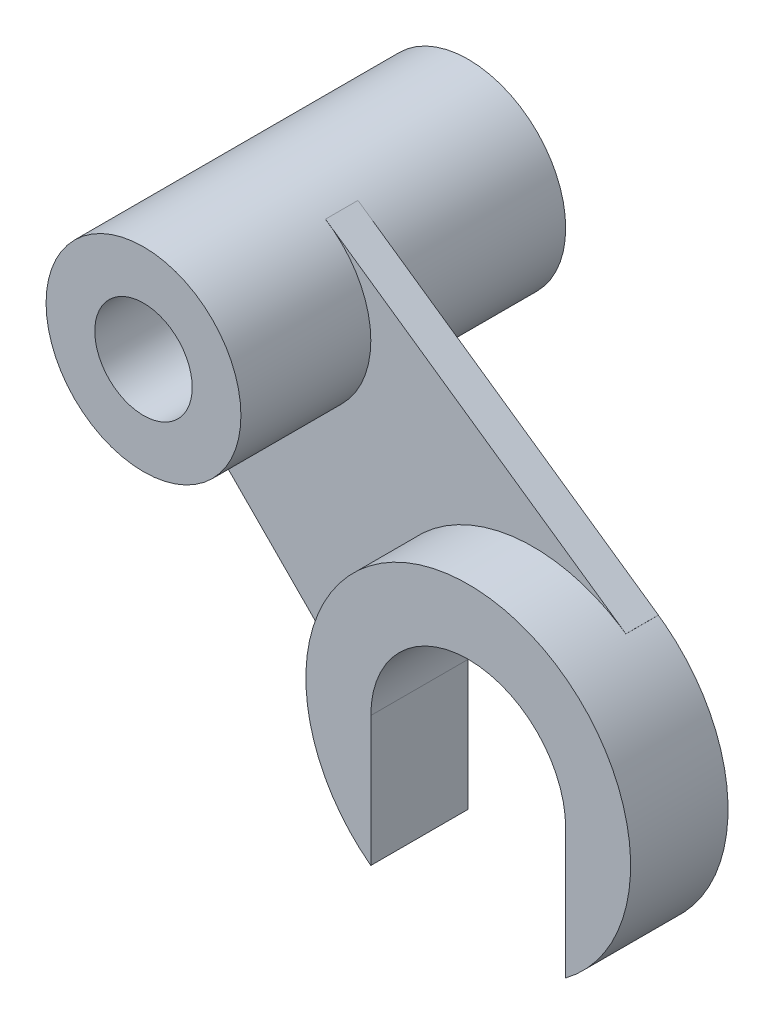
ISO-10303-21;
HEADER;
FILE_DESCRIPTION(('STEP AP214'),'2;1');
FILE_NAME('part.step','',(''),(''),'','','');
FILE_SCHEMA(('AUTOMOTIVE_DESIGN { 1 0 10303 214 1 1 1 1 }'));
ENDSEC;
DATA;
#1=APPLICATION_CONTEXT('core data for automotive mechanical design processes');
#2=APPLICATION_PROTOCOL_DEFINITION('international standard','automotive_design',2000,#1);
#3=PRODUCT_CONTEXT('',#1,'mechanical');
#4=PRODUCT('Part','Part','',(#3));
#5=PRODUCT_RELATED_PRODUCT_CATEGORY('part','',(#4));
#6=PRODUCT_DEFINITION_FORMATION('','',#4);
#7=PRODUCT_DEFINITION_CONTEXT('part definition',#1,'design');
#8=PRODUCT_DEFINITION('design','',#6,#7);
#9=PRODUCT_DEFINITION_SHAPE('','',#8);
#10=(LENGTH_UNIT() NAMED_UNIT(*) SI_UNIT(.MILLI.,.METRE.));
#11=(NAMED_UNIT(*) PLANE_ANGLE_UNIT() SI_UNIT($,.RADIAN.));
#12=(NAMED_UNIT(*) SI_UNIT($,.STERADIAN.) SOLID_ANGLE_UNIT());
#13=UNCERTAINTY_MEASURE_WITH_UNIT(LENGTH_MEASURE(1.E-05),#10,'distance_accuracy_value','');
#14=(GEOMETRIC_REPRESENTATION_CONTEXT(3) GLOBAL_UNCERTAINTY_ASSIGNED_CONTEXT((#13)) GLOBAL_UNIT_ASSIGNED_CONTEXT((#10,
#11,#12)) REPRESENTATION_CONTEXT('',''));
#15=CARTESIAN_POINT('',(0.,0.,0.));
#16=DIRECTION('',(0.,0.,1.));
#17=DIRECTION('',(1.,0.,0.));
#18=AXIS2_PLACEMENT_3D('',#15,#16,#17);
#19=CARTESIAN_POINT('',(-101.405140794996,67.6303169758458,10.));
#20=DIRECTION('',(-0.821220590072769,-0.570610850265339,0.));
#21=DIRECTION('',(0.570610850265339,-0.821220590072769,0.));
#22=AXIS2_PLACEMENT_3D('',#19,#20,#21);
#23=PLANE('',#22);
#24=DIRECTION('',(-0.570610850265339,0.821220590072769,0.));
#25=VECTOR('',#24,1.);
#26=CARTESIAN_POINT('',(-101.405140794996,67.6303169758458,0.));
#27=LINE('',#26,#25);
#28=CARTESIAN_POINT('',(-101.405140794996,67.6303169758458,0.));
#29=VERTEX_POINT('',#28);
#30=CARTESIAN_POINT('',(-110.,80.,0.));
#31=VERTEX_POINT('',#30);
#32=EDGE_CURVE('E164',#29,#31,#27,.T.);
#33=ORIENTED_EDGE('',*,*,#32,.T.);
#34=DIRECTION('',(0.,0.,-1.));
#35=VECTOR('',#34,1.);
#36=CARTESIAN_POINT('',(-110.,80.,10.));
#37=LINE('',#36,#35);
#38=CARTESIAN_POINT('',(-110.,80.,10.));
#39=VERTEX_POINT('',#38);
#40=EDGE_CURVE('E12',#39,#31,#37,.T.);
#41=ORIENTED_EDGE('',*,*,#40,.F.);
#42=DIRECTION('',(-0.570610850265339,0.821220590072769,0.));
#43=VECTOR('',#42,1.);
#44=CARTESIAN_POINT('',(-101.405140794996,67.6303169758458,10.));
#45=LINE('',#44,#43);
#46=CARTESIAN_POINT('',(-101.405140794996,67.6303169758458,10.));
#47=VERTEX_POINT('',#46);
#48=EDGE_CURVE('E184',#47,#39,#45,.T.);
#49=ORIENTED_EDGE('',*,*,#48,.F.);
#50=DIRECTION('',(0.,0.,-1.));
#51=VECTOR('',#50,1.);
#52=CARTESIAN_POINT('',(-101.405140794996,67.6303169758458,10.));
#53=LINE('',#52,#51);
#54=EDGE_CURVE('E160',#47,#29,#53,.T.);
#55=ORIENTED_EDGE('',*,*,#54,.T.);
#56=EDGE_LOOP('',(#33,#41,#49,#55));
#57=FACE_BOUND('',#56,.T.);
#58=ADVANCED_FACE('F50',(#57),#23,.F.);
#59=CARTESIAN_POINT('',(-110.,80.,10.));
#60=DIRECTION('',(1.,0.,0.));
#61=DIRECTION('',(0.,0.,-1.));
#62=AXIS2_PLACEMENT_3D('',#59,#60,#61);
#63=PLANE('',#62);
#64=DIRECTION('',(0.,-1.,0.));
#65=VECTOR('',#64,1.);
#66=CARTESIAN_POINT('',(-110.,80.,0.));
#67=LINE('',#66,#65);
#68=CARTESIAN_POINT('',(-110.,40.,0.));
#69=VERTEX_POINT('',#68);
#70=EDGE_CURVE('E167',#31,#69,#67,.T.);
#71=ORIENTED_EDGE('',*,*,#70,.T.);
#72=DIRECTION('',(0.,0.,-1.));
#73=VECTOR('',#72,1.);
#74=CARTESIAN_POINT('',(-110.,40.,10.));
#75=LINE('',#74,#73);
#76=CARTESIAN_POINT('',(-110.,40.,10.));
#77=VERTEX_POINT('',#76);
#78=EDGE_CURVE('E58',#77,#69,#75,.T.);
#79=ORIENTED_EDGE('',*,*,#78,.F.);
#80=DIRECTION('',(0.,-1.,0.));
#81=VECTOR('',#80,1.);
#82=CARTESIAN_POINT('',(-110.,80.,10.));
#83=LINE('',#82,#81);
#84=EDGE_CURVE('E118',#39,#77,#83,.T.);
#85=ORIENTED_EDGE('',*,*,#84,.F.);
#86=ORIENTED_EDGE('',*,*,#40,.T.);
#87=EDGE_LOOP('',(#71,#79,#85,#86));
#88=FACE_BOUND('',#87,.T.);
#89=ADVANCED_FACE('F256',(#88),#63,.F.);
#90=CARTESIAN_POINT('',(-110.,40.,10.));
#91=DIRECTION('',(0.710452707861558,0.703744946619285,0.));
#92=DIRECTION('',(-0.703744946619285,0.710452707861558,0.));
#93=AXIS2_PLACEMENT_3D('',#90,#91,#92);
#94=PLANE('',#93);
#95=DIRECTION('',(0.703744946619285,-0.710452707861558,0.));
#96=VECTOR('',#95,1.);
#97=CARTESIAN_POINT('',(-110.,40.,0.));
#98=LINE('',#97,#96);
#99=CARTESIAN_POINT('',(-35.5226353930779,-35.1872473309642,0.));
#100=VERTEX_POINT('',#99);
#101=EDGE_CURVE('E169',#69,#100,#98,.T.);
#102=ORIENTED_EDGE('',*,*,#101,.T.);
#103=DIRECTION('',(0.,0.,-1.));
#104=VECTOR('',#103,1.);
#105=CARTESIAN_POINT('',(-35.5226353930779,-35.1872473309642,10.));
#106=LINE('',#105,#104);
#107=CARTESIAN_POINT('',(-35.5226353930779,-35.1872473309642,10.));
#108=VERTEX_POINT('',#107);
#109=EDGE_CURVE('E200',#108,#100,#106,.T.);
#110=ORIENTED_EDGE('',*,*,#109,.F.);
#111=DIRECTION('',(0.703744946619285,-0.710452707861558,0.));
#112=VECTOR('',#111,1.);
#113=CARTESIAN_POINT('',(-110.,40.,10.));
#114=LINE('',#113,#112);
#115=EDGE_CURVE('E208',#77,#108,#114,.T.);
#116=ORIENTED_EDGE('',*,*,#115,.F.);
#117=ORIENTED_EDGE('',*,*,#78,.T.);
#118=EDGE_LOOP('',(#102,#110,#116,#117));
#119=FACE_BOUND('',#118,.T.);
#120=ADVANCED_FACE('F206',(#119),#94,.F.);
#121=CARTESIAN_POINT('',(-35.5226353930779,-35.1872473309642,10.));
#122=DIRECTION('',(-1.,0.,0.));
#123=DIRECTION('',(0.,0.,1.));
#124=AXIS2_PLACEMENT_3D('',#121,#122,#123);
#125=PLANE('',#124);
#126=DIRECTION('',(0.,1.,0.));
#127=VECTOR('',#126,1.);
#128=CARTESIAN_POINT('',(-35.5226353930779,-35.1872473309642,0.));
#129=LINE('',#128,#127);
#130=CARTESIAN_POINT('',(-35.5226353930779,24.4244066469658,0.));
#131=VERTEX_POINT('',#130);
#132=EDGE_CURVE('E171',#100,#131,#129,.T.);
#133=ORIENTED_EDGE('',*,*,#132,.T.);
#134=DIRECTION('',(0.,0.,-1.));
#135=VECTOR('',#134,1.);
#136=CARTESIAN_POINT('',(-35.5226353930779,24.4244066469658,10.));
#137=LINE('',#136,#135);
#138=CARTESIAN_POINT('',(-35.5226353930779,24.4244066469658,10.));
#139=VERTEX_POINT('',#138);
#140=EDGE_CURVE('E197',#139,#131,#137,.T.);
#141=ORIENTED_EDGE('',*,*,#140,.F.);
#142=DIRECTION('',(0.,1.,0.));
#143=VECTOR('',#142,1.);
#144=CARTESIAN_POINT('',(-35.5226353930779,-35.1872473309642,10.));
#145=LINE('',#144,#143);
#146=EDGE_CURVE('E226',#108,#139,#145,.T.);
#147=ORIENTED_EDGE('',*,*,#146,.F.);
#148=ORIENTED_EDGE('',*,*,#109,.T.);
#149=EDGE_LOOP('',(#133,#141,#147,#148));
#150=FACE_BOUND('',#149,.T.);
#151=ADVANCED_FACE('F217',(#150),#125,.F.);
#152=CARTESIAN_POINT('',(-35.5226353930779,24.4244066469658,10.));
#153=DIRECTION('',(-0.401563978992684,0.915830972819528,0.));
#154=DIRECTION('',(-0.915830972819528,-0.401563978992684,0.));
#155=AXIS2_PLACEMENT_3D('',#152,#153,#154);
#156=PLANE('',#155);
#157=DIRECTION('',(0.915830972819528,0.401563978992684,0.));
#158=VECTOR('',#157,1.);
#159=CARTESIAN_POINT('',(-35.5226353930779,24.4244066469658,0.));
#160=LINE('',#159,#158);
#161=CARTESIAN_POINT('',(0.,40.,0.));
#162=VERTEX_POINT('',#161);
#163=EDGE_CURVE('E173',#131,#162,#160,.T.);
#164=ORIENTED_EDGE('',*,*,#163,.T.);
#165=DIRECTION('',(0.,0.,-1.));
#166=VECTOR('',#165,1.);
#167=CARTESIAN_POINT('',(0.,40.,10.));
#168=LINE('',#167,#166);
#169=CARTESIAN_POINT('',(0.,40.,10.));
#170=VERTEX_POINT('',#169);
#171=EDGE_CURVE('E194',#170,#162,#168,.T.);
#172=ORIENTED_EDGE('',*,*,#171,.F.);
#173=DIRECTION('',(0.915830972819528,0.401563978992684,0.));
#174=VECTOR('',#173,1.);
#175=CARTESIAN_POINT('',(-35.5226353930779,24.4244066469658,10.));
#176=LINE('',#175,#174);
#177=EDGE_CURVE('E223',#139,#170,#176,.T.);
#178=ORIENTED_EDGE('',*,*,#177,.F.);
#179=ORIENTED_EDGE('',*,*,#140,.T.);
#180=EDGE_LOOP('',(#164,#172,#178,#179));
#181=FACE_BOUND('',#180,.T.);
#182=ADVANCED_FACE('F221',(#181),#156,.F.);
#183=CARTESIAN_POINT('',(0.,40.,10.));
#184=DIRECTION('',(0.303855521522255,0.952718123077565,0.));
#185=DIRECTION('',(-0.952718123077565,0.303855521522255,0.));
#186=AXIS2_PLACEMENT_3D('',#183,#184,#185);
#187=PLANE('',#186);
#188=DIRECTION('',(0.952718123077565,-0.303855521522255,0.));
#189=VECTOR('',#188,1.);
#190=CARTESIAN_POINT('',(0.,40.,0.));
#191=LINE('',#190,#189);
#192=CARTESIAN_POINT('',(24.4181017194965,32.2122033234829,0.));
#193=VERTEX_POINT('',#192);
#194=EDGE_CURVE('E175',#162,#193,#191,.T.);
#195=ORIENTED_EDGE('',*,*,#194,.T.);
#196=DIRECTION('',(0.,0.,-1.));
#197=VECTOR('',#196,1.);
#198=CARTESIAN_POINT('',(24.4181017194965,32.2122033234829,10.));
#199=LINE('',#198,#197);
#200=CARTESIAN_POINT('',(24.4181017194965,32.2122033234829,10.));
#201=VERTEX_POINT('',#200);
#202=EDGE_CURVE('E191',#201,#193,#199,.T.);
#203=ORIENTED_EDGE('',*,*,#202,.F.);
#204=DIRECTION('',(0.952718123077565,-0.303855521522255,0.));
#205=VECTOR('',#204,1.);
#206=CARTESIAN_POINT('',(0.,40.,10.));
#207=LINE('',#206,#205);
#208=EDGE_CURVE('E225',#170,#201,#207,.T.);
#209=ORIENTED_EDGE('',*,*,#208,.F.);
#210=ORIENTED_EDGE('',*,*,#171,.T.);
#211=EDGE_LOOP('',(#195,#203,#209,#210));
#212=FACE_BOUND('',#211,.T.);
#213=ADVANCED_FACE('F269',(#212),#187,.F.);
#214=CARTESIAN_POINT('',(24.4181017194965,32.2122033234829,10.));
#215=DIRECTION('',(-0.905915500696514,0.423458505166427,0.));
#216=DIRECTION('',(-0.423458505166427,-0.905915500696514,0.));
#217=AXIS2_PLACEMENT_3D('',#214,#215,#216);
#218=PLANE('',#217);
#219=DIRECTION('',(0.423458505166427,0.905915500696514,0.));
#220=VECTOR('',#219,1.);
#221=CARTESIAN_POINT('',(24.4181017194965,32.2122033234829,0.));
#222=LINE('',#221,#220);
#223=CARTESIAN_POINT('',(28.5485272676876,41.0485272676876,0.));
#224=VERTEX_POINT('',#223);
#225=EDGE_CURVE('E177',#193,#224,#222,.T.);
#226=ORIENTED_EDGE('',*,*,#225,.T.);
#227=DIRECTION('',(0.,0.,-1.));
#228=VECTOR('',#227,1.);
#229=CARTESIAN_POINT('',(28.5485272676876,41.0485272676876,10.));
#230=LINE('',#229,#228);
#231=CARTESIAN_POINT('',(28.5485272676876,41.0485272676876,10.));
#232=VERTEX_POINT('',#231);
#233=EDGE_CURVE('E188',#232,#224,#230,.T.);
#234=ORIENTED_EDGE('',*,*,#233,.F.);
#235=DIRECTION('',(0.423458505166427,0.905915500696514,0.));
#236=VECTOR('',#235,1.);
#237=CARTESIAN_POINT('',(24.4181017194965,32.2122033234829,10.));
#238=LINE('',#237,#236);
#239=EDGE_CURVE('E228',#201,#232,#238,.T.);
#240=ORIENTED_EDGE('',*,*,#239,.F.);
#241=ORIENTED_EDGE('',*,*,#202,.T.);
#242=EDGE_LOOP('',(#226,#234,#240,#241));
#243=FACE_BOUND('',#242,.T.);
#244=ADVANCED_FACE('F237',(#243),#218,.F.);
#245=CARTESIAN_POINT('',(28.5485272676876,41.0485272676876,10.));
#246=DIRECTION('',(-0.570970545353753,-0.820970545353753,0.));
#247=DIRECTION('',(0.820970545353753,-0.570970545353753,0.));
#248=AXIS2_PLACEMENT_3D('',#245,#246,#247);
#249=PLANE('',#248);
#250=DIRECTION('',(-0.820970545353753,0.570970545353753,0.));
#251=VECTOR('',#250,1.);
#252=CARTESIAN_POINT('',(28.5485272676876,41.0485272676876,0.));
#253=LINE('',#252,#251);
#254=CARTESIAN_POINT('',(-63.9600885233091,105.386639161028,0.));
#255=VERTEX_POINT('',#254);
#256=EDGE_CURVE('E179',#224,#255,#253,.T.);
#257=ORIENTED_EDGE('',*,*,#256,.T.);
#258=DIRECTION('',(0.,0.,-1.));
#259=VECTOR('',#258,1.);
#260=CARTESIAN_POINT('',(-63.9600885233091,105.386639161028,10.));
#261=LINE('',#260,#259);
#262=CARTESIAN_POINT('',(-63.9600885233091,105.386639161028,10.));
#263=VERTEX_POINT('',#262);
#264=EDGE_CURVE('E155',#263,#255,#261,.T.);
#265=ORIENTED_EDGE('',*,*,#264,.F.);
#266=DIRECTION('',(-0.820970545353753,0.570970545353753,0.));
#267=VECTOR('',#266,1.);
#268=CARTESIAN_POINT('',(28.5485272676876,41.0485272676876,10.));
#269=LINE('',#268,#267);
#270=EDGE_CURVE('E146',#232,#263,#269,.T.);
#271=ORIENTED_EDGE('',*,*,#270,.F.);
#272=ORIENTED_EDGE('',*,*,#233,.T.);
#273=EDGE_LOOP('',(#257,#265,#271,#272));
#274=FACE_BOUND('',#273,.T.);
#275=ADVANCED_FACE('F241',(#274),#249,.F.);
#276=CARTESIAN_POINT('',(-63.9600885233091,105.386639161028,10.));
#277=DIRECTION('',(0.984250984251476,0.176776695296642,0.));
#278=DIRECTION('',(-0.176776695296642,0.984250984251476,0.));
#279=AXIS2_PLACEMENT_3D('',#276,#277,#278);
#280=PLANE('',#279);
#281=DIRECTION('',(0.176776695296642,-0.984250984251475,0.));
#282=VECTOR('',#281,1.);
#283=CARTESIAN_POINT('',(-63.9600885233091,105.386639161028,0.));
#284=LINE('',#283,#282);
#285=CARTESIAN_POINT('',(-57.4609690598027,69.2010734223432,0.));
#286=VERTEX_POINT('',#285);
#287=EDGE_CURVE('E154',#255,#286,#284,.T.);
#288=ORIENTED_EDGE('',*,*,#287,.T.);
#289=DIRECTION('',(0.,0.,-1.));
#290=VECTOR('',#289,1.);
#291=CARTESIAN_POINT('',(-57.4609690598027,69.2010734223432,10.));
#292=LINE('',#291,#290);
#293=CARTESIAN_POINT('',(-57.4609690598027,69.2010734223432,10.));
#294=VERTEX_POINT('',#293);
#295=EDGE_CURVE('E151',#294,#286,#292,.T.);
#296=ORIENTED_EDGE('',*,*,#295,.F.);
#297=DIRECTION('',(0.176776695296642,-0.984250984251475,0.));
#298=VECTOR('',#297,1.);
#299=CARTESIAN_POINT('',(-63.9600885233091,105.386639161028,10.));
#300=LINE('',#299,#298);
#301=EDGE_CURVE('E140',#263,#294,#300,.T.);
#302=ORIENTED_EDGE('',*,*,#301,.F.);
#303=ORIENTED_EDGE('',*,*,#264,.T.);
#304=EDGE_LOOP('',(#288,#296,#302,#303));
#305=FACE_BOUND('',#304,.T.);
#306=ADVANCED_FACE('F152',(#305),#280,.F.);
#307=CARTESIAN_POINT('',(-57.4609690598027,69.2010734223432,10.));
#308=DIRECTION('',(0.491035198471503,-0.871139732684747,0.));
#309=DIRECTION('',(0.871139732684747,0.491035198471503,0.));
#310=AXIS2_PLACEMENT_3D('',#307,#308,#309);
#311=PLANE('',#310);
#312=DIRECTION('',(-0.871139732684747,-0.491035198471503,0.));
#313=VECTOR('',#312,1.);
#314=CARTESIAN_POINT('',(-57.4609690598027,69.2010734223432,0.));
#315=LINE('',#314,#313);
#316=CARTESIAN_POINT('',(-82.9806424287928,54.8164030789865,0.));
#317=VERTEX_POINT('',#316);
#318=EDGE_CURVE('E104',#286,#317,#315,.T.);
#319=ORIENTED_EDGE('',*,*,#318,.T.);
#320=DIRECTION('',(0.,0.,-1.));
#321=VECTOR('',#320,1.);
#322=CARTESIAN_POINT('',(-82.9806424287928,54.8164030789865,10.));
#323=LINE('',#322,#321);
#324=CARTESIAN_POINT('',(-82.9806424287928,54.8164030789865,10.));
#325=VERTEX_POINT('',#324);
#326=EDGE_CURVE('E156',#325,#317,#323,.T.);
#327=ORIENTED_EDGE('',*,*,#326,.F.);
#328=DIRECTION('',(-0.871139732684747,-0.491035198471503,0.));
#329=VECTOR('',#328,1.);
#330=CARTESIAN_POINT('',(-57.4609690598027,69.2010734223432,10.));
#331=LINE('',#330,#329);
#332=EDGE_CURVE('E144',#294,#325,#331,.T.);
#333=ORIENTED_EDGE('',*,*,#332,.F.);
#334=ORIENTED_EDGE('',*,*,#295,.T.);
#335=EDGE_LOOP('',(#319,#327,#333,#334));
#336=FACE_BOUND('',#335,.T.);
#337=ADVANCED_FACE('F158',(#336),#311,.F.);
#338=CARTESIAN_POINT('',(-82.9806424287928,54.8164030789865,10.));
#339=DIRECTION('',(-0.570970545353752,-0.820970545353753,0.));
#340=DIRECTION('',(0.820970545353753,-0.570970545353753,0.));
#341=AXIS2_PLACEMENT_3D('',#338,#339,#340);
#342=PLANE('',#341);
#343=DIRECTION('',(-0.820970545353753,0.570970545353752,0.));
#344=VECTOR('',#343,1.);
#345=CARTESIAN_POINT('',(-82.9806424287928,54.8164030789865,0.));
#346=LINE('',#345,#344);
#347=EDGE_CURVE('E110',#317,#29,#346,.T.);
#348=ORIENTED_EDGE('',*,*,#347,.T.);
#349=ORIENTED_EDGE('',*,*,#54,.F.);
#350=DIRECTION('',(-0.820970545353753,0.570970545353752,0.));
#351=VECTOR('',#350,1.);
#352=CARTESIAN_POINT('',(-82.9806424287928,54.8164030789865,10.));
#353=LINE('',#352,#351);
#354=EDGE_CURVE('E66',#325,#47,#353,.T.);
#355=ORIENTED_EDGE('',*,*,#354,.F.);
#356=ORIENTED_EDGE('',*,*,#326,.T.);
#357=EDGE_LOOP('',(#348,#349,#355,#356));
#358=FACE_BOUND('',#357,.T.);
#359=ADVANCED_FACE('F245',(#358),#342,.F.);
#360=CARTESIAN_POINT('',(0.,0.,10.));
#361=DIRECTION('',(0.,0.,1.));
#362=DIRECTION('',(1.,0.,0.));
#363=AXIS2_PLACEMENT_3D('',#360,#361,#362);
#364=PLANE('',#363);
#365=ORIENTED_EDGE('',*,*,#48,.T.);
#366=ORIENTED_EDGE('',*,*,#84,.T.);
#367=ORIENTED_EDGE('',*,*,#115,.T.);
#368=ORIENTED_EDGE('',*,*,#146,.T.);
#369=ORIENTED_EDGE('',*,*,#177,.T.);
#370=ORIENTED_EDGE('',*,*,#208,.T.);
#371=ORIENTED_EDGE('',*,*,#239,.T.);
#372=ORIENTED_EDGE('',*,*,#270,.T.);
#373=ORIENTED_EDGE('',*,*,#301,.T.);
#374=ORIENTED_EDGE('',*,*,#332,.T.);
#375=ORIENTED_EDGE('',*,*,#354,.T.);
#376=EDGE_LOOP('',(#365,#366,#367,#368,#369,#370,#371,#372,#373,#374,#375));
#377=FACE_BOUND('',#376,.T.);
#378=ADVANCED_FACE('F142',(#377),#364,.T.);
#379=CARTESIAN_POINT('',(0.,0.,0.));
#380=DIRECTION('',(0.,0.,1.));
#381=DIRECTION('',(1.,0.,0.));
#382=AXIS2_PLACEMENT_3D('',#379,#380,#381);
#383=PLANE('',#382);
#384=ORIENTED_EDGE('',*,*,#32,.F.);
#385=ORIENTED_EDGE('',*,*,#347,.F.);
#386=ORIENTED_EDGE('',*,*,#318,.F.);
#387=ORIENTED_EDGE('',*,*,#287,.F.);
#388=ORIENTED_EDGE('',*,*,#256,.F.);
#389=ORIENTED_EDGE('',*,*,#225,.F.);
#390=ORIENTED_EDGE('',*,*,#194,.F.);
#391=ORIENTED_EDGE('',*,*,#163,.F.);
#392=ORIENTED_EDGE('',*,*,#132,.F.);
#393=ORIENTED_EDGE('',*,*,#101,.F.);
#394=ORIENTED_EDGE('',*,*,#70,.F.);
#395=EDGE_LOOP('',(#384,#385,#386,#387,#388,#389,#390,#391,#392,#393,#394));
#396=FACE_BOUND('',#395,.T.);
#397=ADVANCED_FACE('F212',(#396),#383,.F.);
#398=CLOSED_SHELL('',(#58,#89,#120,#151,#182,#213,#244,#275,#306,#337,#359,#378,#397));
#399=MANIFOLD_SOLID_BREP('B2',#398);
#400=CARTESIAN_POINT('',(-80.,80.,50.));
#401=DIRECTION('',(0.,0.,-1.));
#402=DIRECTION('',(-1.,0.,0.));
#403=AXIS2_PLACEMENT_3D('',#400,#401,#402);
#404=CYLINDRICAL_SURFACE('',#403,30.);
#405=CARTESIAN_POINT('',(-80.,80.,50.));
#406=DIRECTION('',(0.,0.,1.));
#407=DIRECTION('',(1.,0.,0.));
#408=AXIS2_PLACEMENT_3D('',#405,#406,#407);
#409=CIRCLE('',#408,30.);
#410=CARTESIAN_POINT('',(-50.,80.,50.));
#411=VERTEX_POINT('',#410);
#412=EDGE_CURVE('E49',#411,#411,#409,.T.);
#413=ORIENTED_EDGE('',*,*,#412,.F.);
#414=EDGE_LOOP('',(#413));
#415=FACE_BOUND('',#414,.T.);
#416=CARTESIAN_POINT('',(-80.,80.,-50.));
#417=DIRECTION('',(0.,0.,1.));
#418=DIRECTION('',(1.,0.,0.));
#419=AXIS2_PLACEMENT_3D('',#416,#417,#418);
#420=CIRCLE('',#419,30.);
#421=CARTESIAN_POINT('',(-50.,80.,-50.));
#422=VERTEX_POINT('',#421);
#423=EDGE_CURVE('E368',#422,#422,#420,.T.);
#424=ORIENTED_EDGE('',*,*,#423,.T.);
#425=EDGE_LOOP('',(#424));
#426=FACE_BOUND('',#425,.T.);
#427=ADVANCED_FACE('F365',(#415,#426),#404,.T.);
#428=CARTESIAN_POINT('',(-80.,80.,50.));
#429=DIRECTION('',(0.,0.,1.));
#430=DIRECTION('',(1.,0.,0.));
#431=AXIS2_PLACEMENT_3D('',#428,#429,#430);
#432=PLANE('',#431);
#433=CARTESIAN_POINT('',(-80.,80.,50.));
#434=DIRECTION('',(0.,0.,1.));
#435=DIRECTION('',(1.,0.,0.));
#436=AXIS2_PLACEMENT_3D('',#433,#434,#435);
#437=CIRCLE('',#436,15.);
#438=CARTESIAN_POINT('',(-65.,80.,50.));
#439=VERTEX_POINT('',#438);
#440=EDGE_CURVE('E377',#439,#439,#437,.T.);
#441=ORIENTED_EDGE('',*,*,#440,.F.);
#442=EDGE_LOOP('',(#441));
#443=FACE_BOUND('',#442,.T.);
#444=ORIENTED_EDGE('',*,*,#412,.T.);
#445=EDGE_LOOP('',(#444));
#446=FACE_BOUND('',#445,.T.);
#447=ADVANCED_FACE('F392',(#443,#446),#432,.T.);
#448=CARTESIAN_POINT('',(-80.,80.,-50.));
#449=DIRECTION('',(0.,0.,1.));
#450=DIRECTION('',(1.,0.,0.));
#451=AXIS2_PLACEMENT_3D('',#448,#449,#450);
#452=PLANE('',#451);
#453=CARTESIAN_POINT('',(-80.,80.,-50.));
#454=DIRECTION('',(0.,0.,1.));
#455=DIRECTION('',(1.,0.,0.));
#456=AXIS2_PLACEMENT_3D('',#453,#454,#455);
#457=CIRCLE('',#456,15.);
#458=CARTESIAN_POINT('',(-65.,80.,-50.));
#459=VERTEX_POINT('',#458);
#460=EDGE_CURVE('E375',#459,#459,#457,.T.);
#461=ORIENTED_EDGE('',*,*,#460,.T.);
#462=EDGE_LOOP('',(#461));
#463=FACE_BOUND('',#462,.T.);
#464=ORIENTED_EDGE('',*,*,#423,.F.);
#465=EDGE_LOOP('',(#464));
#466=FACE_BOUND('',#465,.T.);
#467=ADVANCED_FACE('F383',(#463,#466),#452,.F.);
#468=CARTESIAN_POINT('',(-80.,80.,-50.));
#469=DIRECTION('',(0.,0.,1.));
#470=DIRECTION('',(1.,0.,0.));
#471=AXIS2_PLACEMENT_3D('',#468,#469,#470);
#472=CYLINDRICAL_SURFACE('',#471,15.);
#473=ORIENTED_EDGE('',*,*,#460,.F.);
#474=EDGE_LOOP('',(#473));
#475=FACE_BOUND('',#474,.T.);
#476=ORIENTED_EDGE('',*,*,#440,.T.);
#477=EDGE_LOOP('',(#476));
#478=FACE_BOUND('',#477,.T.);
#479=ADVANCED_FACE('F386',(#475,#478),#472,.F.);
#480=CLOSED_SHELL('',(#427,#447,#467,#479));
#481=MANIFOLD_SOLID_BREP('B6',#480);
#482=CARTESIAN_POINT('',(0.,0.,30.));
#483=DIRECTION('',(0.,0.,-1.));
#484=DIRECTION('',(-1.,0.,0.));
#485=AXIS2_PLACEMENT_3D('',#482,#483,#484);
#486=CYLINDRICAL_SURFACE('',#485,30.);
#487=CARTESIAN_POINT('',(0.,0.,0.));
#488=DIRECTION('',(0.,0.,1.));
#489=DIRECTION('',(1.,0.,0.));
#490=AXIS2_PLACEMENT_3D('',#487,#488,#489);
#491=CIRCLE('',#490,30.);
#492=CARTESIAN_POINT('',(30.,0.,0.));
#493=VERTEX_POINT('',#492);
#494=CARTESIAN_POINT('',(-30.,0.,0.));
#495=VERTEX_POINT('',#494);
#496=EDGE_CURVE('E492',#493,#495,#491,.T.);
#497=ORIENTED_EDGE('',*,*,#496,.F.);
#498=DIRECTION('',(0.,0.,-1.));
#499=VECTOR('',#498,1.);
#500=CARTESIAN_POINT('',(30.,0.,30.));
#501=LINE('',#500,#499);
#502=CARTESIAN_POINT('',(30.,0.,30.));
#503=VERTEX_POINT('',#502);
#504=EDGE_CURVE('E363',#503,#493,#501,.T.);
#505=ORIENTED_EDGE('',*,*,#504,.F.);
#506=CARTESIAN_POINT('',(0.,0.,30.));
#507=DIRECTION('',(0.,0.,1.));
#508=DIRECTION('',(1.,0.,0.));
#509=AXIS2_PLACEMENT_3D('',#506,#507,#508);
#510=CIRCLE('',#509,30.);
#511=CARTESIAN_POINT('',(-30.,0.,30.));
#512=VERTEX_POINT('',#511);
#513=EDGE_CURVE('E487',#503,#512,#510,.T.);
#514=ORIENTED_EDGE('',*,*,#513,.T.);
#515=DIRECTION('',(0.,0.,-1.));
#516=VECTOR('',#515,1.);
#517=CARTESIAN_POINT('',(-30.,0.,30.));
#518=LINE('',#517,#516);
#519=EDGE_CURVE('E430',#512,#495,#518,.T.);
#520=ORIENTED_EDGE('',*,*,#519,.T.);
#521=EDGE_LOOP('',(#497,#505,#514,#520));
#522=FACE_BOUND('',#521,.T.);
#523=ADVANCED_FACE('F427',(#522),#486,.F.);
#524=CARTESIAN_POINT('',(30.,0.,30.));
#525=DIRECTION('',(1.,0.,0.));
#526=DIRECTION('',(0.,1.,0.));
#527=AXIS2_PLACEMENT_3D('',#524,#525,#526);
#528=PLANE('',#527);
#529=DIRECTION('',(0.,-1.,0.));
#530=VECTOR('',#529,1.);
#531=CARTESIAN_POINT('',(30.,0.,0.));
#532=LINE('',#531,#530);
#533=CARTESIAN_POINT('',(30.,-40.,0.));
#534=VERTEX_POINT('',#533);
#535=EDGE_CURVE('E460',#493,#534,#532,.T.);
#536=ORIENTED_EDGE('',*,*,#535,.T.);
#537=DIRECTION('',(0.,0.,-1.));
#538=VECTOR('',#537,1.);
#539=CARTESIAN_POINT('',(30.,-40.,30.));
#540=LINE('',#539,#538);
#541=CARTESIAN_POINT('',(30.,-40.,30.));
#542=VERTEX_POINT('',#541);
#543=EDGE_CURVE('E436',#542,#534,#540,.T.);
#544=ORIENTED_EDGE('',*,*,#543,.F.);
#545=DIRECTION('',(0.,-1.,0.));
#546=VECTOR('',#545,1.);
#547=CARTESIAN_POINT('',(30.,0.,30.));
#548=LINE('',#547,#546);
#549=EDGE_CURVE('E477',#503,#542,#548,.T.);
#550=ORIENTED_EDGE('',*,*,#549,.F.);
#551=ORIENTED_EDGE('',*,*,#504,.T.);
#552=EDGE_LOOP('',(#536,#544,#550,#551));
#553=FACE_BOUND('',#552,.T.);
#554=ADVANCED_FACE('F502',(#553),#528,.F.);
#555=CARTESIAN_POINT('',(0.,0.,30.));
#556=DIRECTION('',(0.,0.,-1.));
#557=DIRECTION('',(-1.,0.,0.));
#558=AXIS2_PLACEMENT_3D('',#555,#556,#557);
#559=CYLINDRICAL_SURFACE('',#558,50.);
#560=CARTESIAN_POINT('',(0.,0.,0.));
#561=DIRECTION('',(0.,0.,1.));
#562=DIRECTION('',(1.,0.,0.));
#563=AXIS2_PLACEMENT_3D('',#560,#561,#562);
#564=CIRCLE('',#563,50.);
#565=CARTESIAN_POINT('',(-30.,-40.,0.));
#566=VERTEX_POINT('',#565);
#567=EDGE_CURVE('E484',#534,#566,#564,.T.);
#568=ORIENTED_EDGE('',*,*,#567,.T.);
#569=DIRECTION('',(0.,0.,-1.));
#570=VECTOR('',#569,1.);
#571=CARTESIAN_POINT('',(-30.,-40.,30.));
#572=LINE('',#571,#570);
#573=CARTESIAN_POINT('',(-30.,-40.,30.));
#574=VERTEX_POINT('',#573);
#575=EDGE_CURVE('E481',#574,#566,#572,.T.);
#576=ORIENTED_EDGE('',*,*,#575,.F.);
#577=CARTESIAN_POINT('',(0.,0.,30.));
#578=DIRECTION('',(0.,0.,1.));
#579=DIRECTION('',(1.,0.,0.));
#580=AXIS2_PLACEMENT_3D('',#577,#578,#579);
#581=CIRCLE('',#580,50.);
#582=EDGE_CURVE('E472',#542,#574,#581,.T.);
#583=ORIENTED_EDGE('',*,*,#582,.F.);
#584=ORIENTED_EDGE('',*,*,#543,.T.);
#585=EDGE_LOOP('',(#568,#576,#583,#584));
#586=FACE_BOUND('',#585,.T.);
#587=ADVANCED_FACE('F482',(#586),#559,.T.);
#588=CARTESIAN_POINT('',(-30.,0.,30.));
#589=DIRECTION('',(1.,0.,0.));
#590=DIRECTION('',(0.,1.,0.));
#591=AXIS2_PLACEMENT_3D('',#588,#589,#590);
#592=PLANE('',#591);
#593=DIRECTION('',(0.,-1.,0.));
#594=VECTOR('',#593,1.);
#595=CARTESIAN_POINT('',(-30.,0.,0.));
#596=LINE('',#595,#594);
#597=EDGE_CURVE('E495',#495,#566,#596,.T.);
#598=ORIENTED_EDGE('',*,*,#597,.F.);
#599=ORIENTED_EDGE('',*,*,#519,.F.);
#600=DIRECTION('',(0.,-1.,0.));
#601=VECTOR('',#600,1.);
#602=CARTESIAN_POINT('',(-30.,0.,30.));
#603=LINE('',#602,#601);
#604=EDGE_CURVE('E476',#512,#574,#603,.T.);
#605=ORIENTED_EDGE('',*,*,#604,.T.);
#606=ORIENTED_EDGE('',*,*,#575,.T.);
#607=EDGE_LOOP('',(#598,#599,#605,#606));
#608=FACE_BOUND('',#607,.T.);
#609=ADVANCED_FACE('F486',(#608),#592,.T.);
#610=CARTESIAN_POINT('',(0.,0.,30.));
#611=DIRECTION('',(0.,0.,1.));
#612=DIRECTION('',(1.,0.,0.));
#613=AXIS2_PLACEMENT_3D('',#610,#611,#612);
#614=PLANE('',#613);
#615=ORIENTED_EDGE('',*,*,#513,.F.);
#616=ORIENTED_EDGE('',*,*,#549,.T.);
#617=ORIENTED_EDGE('',*,*,#582,.T.);
#618=ORIENTED_EDGE('',*,*,#604,.F.);
#619=EDGE_LOOP('',(#615,#616,#617,#618));
#620=FACE_BOUND('',#619,.T.);
#621=ADVANCED_FACE('F475',(#620),#614,.T.);
#622=CARTESIAN_POINT('',(0.,0.,0.));
#623=DIRECTION('',(0.,0.,1.));
#624=DIRECTION('',(1.,0.,0.));
#625=AXIS2_PLACEMENT_3D('',#622,#623,#624);
#626=PLANE('',#625);
#627=ORIENTED_EDGE('',*,*,#496,.T.);
#628=ORIENTED_EDGE('',*,*,#597,.T.);
#629=ORIENTED_EDGE('',*,*,#567,.F.);
#630=ORIENTED_EDGE('',*,*,#535,.F.);
#631=EDGE_LOOP('',(#627,#628,#629,#630));
#632=FACE_BOUND('',#631,.T.);
#633=ADVANCED_FACE('F500',(#632),#626,.F.);
#634=CLOSED_SHELL('',(#523,#554,#587,#609,#621,#633));
#635=MANIFOLD_SOLID_BREP('B44',#634);
#636=ADVANCED_BREP_SHAPE_REPRESENTATION('',(#18,#399,#481,#635),#14);
#637=SHAPE_DEFINITION_REPRESENTATION(#9,#636);
ENDSEC;
END-ISO-10303-21;
